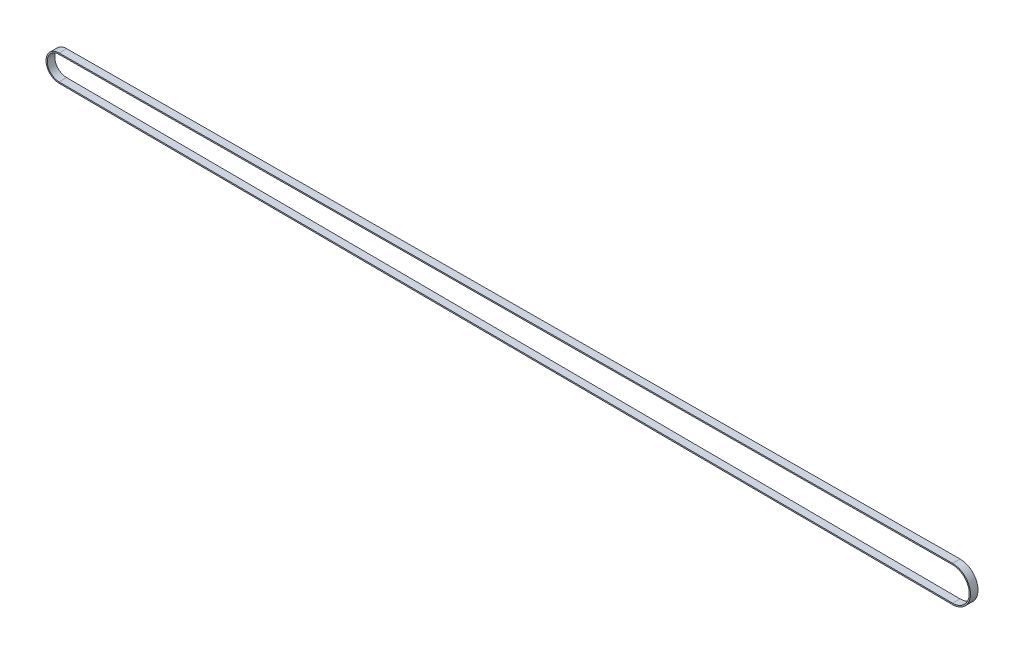
ISO-10303-21;
HEADER;
FILE_DESCRIPTION(('STEP AP214'),'2;1');
FILE_NAME('part.step','',(''),(''),'','','');
FILE_SCHEMA(('AUTOMOTIVE_DESIGN { 1 0 10303 214 1 1 1 1 }'));
ENDSEC;
DATA;
#1=APPLICATION_CONTEXT('core data for automotive mechanical design processes');
#2=APPLICATION_PROTOCOL_DEFINITION('international standard','automotive_design',2000,#1);
#3=PRODUCT_CONTEXT('',#1,'mechanical');
#4=PRODUCT('Part','Part','',(#3));
#5=PRODUCT_RELATED_PRODUCT_CATEGORY('part','',(#4));
#6=PRODUCT_DEFINITION_FORMATION('','',#4);
#7=PRODUCT_DEFINITION_CONTEXT('part definition',#1,'design');
#8=PRODUCT_DEFINITION('design','',#6,#7);
#9=PRODUCT_DEFINITION_SHAPE('','',#8);
#10=(LENGTH_UNIT() NAMED_UNIT(*) SI_UNIT(.MILLI.,.METRE.));
#11=(NAMED_UNIT(*) PLANE_ANGLE_UNIT() SI_UNIT($,.RADIAN.));
#12=(NAMED_UNIT(*) SI_UNIT($,.STERADIAN.) SOLID_ANGLE_UNIT());
#13=UNCERTAINTY_MEASURE_WITH_UNIT(LENGTH_MEASURE(1.E-05),#10,'distance_accuracy_value','');
#14=(GEOMETRIC_REPRESENTATION_CONTEXT(3) GLOBAL_UNCERTAINTY_ASSIGNED_CONTEXT((#13)) GLOBAL_UNIT_ASSIGNED_CONTEXT((#10,
#11,#12)) REPRESENTATION_CONTEXT('',''));
#15=CARTESIAN_POINT('',(0.,0.,0.));
#16=DIRECTION('',(0.,0.,1.));
#17=DIRECTION('',(1.,0.,0.));
#18=AXIS2_PLACEMENT_3D('',#15,#16,#17);
#19=CARTESIAN_POINT('',(-6.06884232011357,-3.48843129409174,328.056465315178));
#20=DIRECTION('',(0.,0.,1.));
#21=DIRECTION('',(1.,0.,0.));
#22=AXIS2_PLACEMENT_3D('',#19,#20,#21);
#23=CYLINDRICAL_SURFACE('',#22,7.15);
#24=CARTESIAN_POINT('',(-6.06884232011357,-3.48843129409174,331.056465315178));
#25=DIRECTION('',(0.,0.,-1.));
#26=DIRECTION('',(-1.,0.,0.));
#27=AXIS2_PLACEMENT_3D('',#24,#25,#26);
#28=CIRCLE('',#27,7.15);
#29=CARTESIAN_POINT('',(-6.10689554139574,-10.6383300313012,331.056465315178));
#30=VERTEX_POINT('',#29);
#31=CARTESIAN_POINT('',(-6.10689554140831,3.6614674431177,331.056465315178));
#32=VERTEX_POINT('',#31);
#33=EDGE_CURVE('E163',#30,#32,#28,.F.);
#34=ORIENTED_EDGE('',*,*,#33,.F.);
#35=DIRECTION('',(0.,0.,1.));
#36=VECTOR('',#35,1.);
#37=CARTESIAN_POINT('',(-6.10689554139574,-10.6383300313012,328.056465315178));
#38=LINE('',#37,#36);
#39=CARTESIAN_POINT('',(-6.10689554139574,-10.6383300313012,328.056465315178));
#40=VERTEX_POINT('',#39);
#41=EDGE_CURVE('E12',#40,#30,#38,.T.);
#42=ORIENTED_EDGE('',*,*,#41,.F.);
#43=CARTESIAN_POINT('',(-6.06884232011357,-3.48843129409174,328.056465315178));
#44=DIRECTION('',(0.,0.,-1.));
#45=DIRECTION('',(-1.,0.,0.));
#46=AXIS2_PLACEMENT_3D('',#43,#44,#45);
#47=CIRCLE('',#46,7.15);
#48=CARTESIAN_POINT('',(-6.10689554140831,3.6614674431177,328.056465315178));
#49=VERTEX_POINT('',#48);
#50=EDGE_CURVE('E167',#40,#49,#47,.F.);
#51=ORIENTED_EDGE('',*,*,#50,.T.);
#52=DIRECTION('',(0.,0.,1.));
#53=VECTOR('',#52,1.);
#54=CARTESIAN_POINT('',(-6.10689554140831,3.6614674431177,328.056465315178));
#55=LINE('',#54,#53);
#56=EDGE_CURVE('E64',#49,#32,#55,.T.);
#57=ORIENTED_EDGE('',*,*,#56,.T.);
#58=EDGE_LOOP('',(#34,#42,#51,#57));
#59=FACE_BOUND('',#58,.T.);
#60=ADVANCED_FACE('F61',(#59),#23,.T.);
#61=CARTESIAN_POINT('',(-6.10689554139574,-10.6383300313012,328.056465315178));
#62=DIRECTION('',(-0.00532212885065316,-0.999985837371958,0.));
#63=DIRECTION('',(0.999985837371959,-0.00532212885065316,0.));
#64=AXIS2_PLACEMENT_3D('',#61,#62,#63);
#65=PLANE('',#64);
#66=DIRECTION('',(0.999985837371959,-0.00532212885065316,0.));
#67=VECTOR('',#66,1.);
#68=CARTESIAN_POINT('',(-6.10689554139574,-10.6383300313012,331.056465315178));
#69=LINE('',#68,#67);
#70=CARTESIAN_POINT('',(-363.096783496579,-8.73835694061135,331.056465315178));
#71=VERTEX_POINT('',#70);
#72=EDGE_CURVE('E171',#71,#30,#69,.T.);
#73=ORIENTED_EDGE('',*,*,#72,.F.);
#74=DIRECTION('',(0.,0.,1.));
#75=VECTOR('',#74,1.);
#76=CARTESIAN_POINT('',(-363.096783496579,-8.73835694061135,328.056465315178));
#77=LINE('',#76,#75);
#78=CARTESIAN_POINT('',(-363.096783496579,-8.73835694061135,328.056465315178));
#79=VERTEX_POINT('',#78);
#80=EDGE_CURVE('E69',#79,#71,#77,.T.);
#81=ORIENTED_EDGE('',*,*,#80,.F.);
#82=DIRECTION('',(0.999985837371959,-0.00532212885065316,0.));
#83=VECTOR('',#82,1.);
#84=CARTESIAN_POINT('',(-6.10689554139574,-10.6383300313012,328.056465315178));
#85=LINE('',#84,#83);
#86=EDGE_CURVE('E178',#79,#40,#85,.T.);
#87=ORIENTED_EDGE('',*,*,#86,.T.);
#88=ORIENTED_EDGE('',*,*,#41,.T.);
#89=EDGE_LOOP('',(#73,#81,#87,#88));
#90=FACE_BOUND('',#89,.T.);
#91=ADVANCED_FACE('F207',(#90),#65,.T.);
#92=CARTESIAN_POINT('',(-363.068842320113,-3.48843129440857,328.056465315178));
#93=DIRECTION('',(0.,0.,1.));
#94=DIRECTION('',(1.,0.,0.));
#95=AXIS2_PLACEMENT_3D('',#92,#93,#94);
#96=CYLINDRICAL_SURFACE('',#95,5.25);
#97=CARTESIAN_POINT('',(-363.068842320113,-3.48843129440857,331.056465315178));
#98=DIRECTION('',(0.,0.,-1.));
#99=DIRECTION('',(-1.,0.,0.));
#100=AXIS2_PLACEMENT_3D('',#97,#98,#99);
#101=CIRCLE('',#100,5.25);
#102=CARTESIAN_POINT('',(-363.096783496589,1.76149435179417,331.056465315178));
#103=VERTEX_POINT('',#102);
#104=EDGE_CURVE('E188',#103,#71,#101,.F.);
#105=ORIENTED_EDGE('',*,*,#104,.F.);
#106=DIRECTION('',(0.,0.,1.));
#107=VECTOR('',#106,1.);
#108=CARTESIAN_POINT('',(-363.096783496589,1.76149435179417,328.056465315178));
#109=LINE('',#108,#107);
#110=CARTESIAN_POINT('',(-363.096783496589,1.76149435179417,328.056465315178));
#111=VERTEX_POINT('',#110);
#112=EDGE_CURVE('E194',#111,#103,#109,.T.);
#113=ORIENTED_EDGE('',*,*,#112,.F.);
#114=CARTESIAN_POINT('',(-363.068842320113,-3.48843129440857,328.056465315178));
#115=DIRECTION('',(0.,0.,-1.));
#116=DIRECTION('',(-1.,0.,0.));
#117=AXIS2_PLACEMENT_3D('',#114,#115,#116);
#118=CIRCLE('',#117,5.25);
#119=EDGE_CURVE('E175',#111,#79,#118,.F.);
#120=ORIENTED_EDGE('',*,*,#119,.T.);
#121=ORIENTED_EDGE('',*,*,#80,.T.);
#122=EDGE_LOOP('',(#105,#113,#120,#121));
#123=FACE_BOUND('',#122,.T.);
#124=ADVANCED_FACE('F211',(#123),#96,.T.);
#125=CARTESIAN_POINT('',(-6.10689554140843,3.6614674431177,328.056465315178));
#126=DIRECTION('',(-0.00532212885242809,0.999985837371949,0.));
#127=DIRECTION('',(-0.999985837371949,-0.0053221288524281,0.));
#128=AXIS2_PLACEMENT_3D('',#125,#126,#127);
#129=PLANE('',#128);
#130=DIRECTION('',(-0.999985837371949,-0.0053221288524281,0.));
#131=VECTOR('',#130,1.);
#132=CARTESIAN_POINT('',(-6.10689554140843,3.6614674431177,331.056465315178));
#133=LINE('',#132,#131);
#134=EDGE_CURVE('E184',#32,#103,#133,.T.);
#135=ORIENTED_EDGE('',*,*,#134,.F.);
#136=ORIENTED_EDGE('',*,*,#56,.F.);
#137=DIRECTION('',(-0.999985837371949,-0.0053221288524281,0.));
#138=VECTOR('',#137,1.);
#139=CARTESIAN_POINT('',(-6.10689554140843,3.6614674431177,328.056465315178));
#140=LINE('',#139,#138);
#141=EDGE_CURVE('E170',#49,#111,#140,.T.);
#142=ORIENTED_EDGE('',*,*,#141,.T.);
#143=ORIENTED_EDGE('',*,*,#112,.T.);
#144=EDGE_LOOP('',(#135,#136,#142,#143));
#145=FACE_BOUND('',#144,.T.);
#146=ADVANCED_FACE('F202',(#145),#129,.T.);
#147=CARTESIAN_POINT('',(-6.06884232011357,-3.48843129409174,328.056465315178));
#148=DIRECTION('',(0.,0.,-1.));
#149=DIRECTION('',(-1.,0.,0.));
#150=AXIS2_PLACEMENT_3D('',#147,#148,#149);
#151=PLANE('',#150);
#152=CARTESIAN_POINT('',(-6.06884232011357,-3.48843129409174,328.056465315178));
#153=DIRECTION('',(0.,0.,1.));
#154=DIRECTION('',(-1.,0.,0.));
#155=AXIS2_PLACEMENT_3D('',#152,#153,#154);
#156=CIRCLE('',#155,6.65);
#157=CARTESIAN_POINT('',(-6.10423447697041,-10.1383371126153,328.056465315178));
#158=VERTEX_POINT('',#157);
#159=CARTESIAN_POINT('',(-6.10423447698221,3.16147452443173,328.056465315178));
#160=VERTEX_POINT('',#159);
#161=EDGE_CURVE('E128',#158,#160,#156,.T.);
#162=ORIENTED_EDGE('',*,*,#161,.T.);
#163=DIRECTION('',(-0.999985837371949,-0.0053221288524281,0.));
#164=VECTOR('',#163,1.);
#165=CARTESIAN_POINT('',(-363.094122432162,1.26150143310819,328.056465315178));
#166=LINE('',#165,#164);
#167=CARTESIAN_POINT('',(-363.094122432162,1.26150143310819,328.056465315178));
#168=VERTEX_POINT('',#167);
#169=EDGE_CURVE('E137',#160,#168,#166,.T.);
#170=ORIENTED_EDGE('',*,*,#169,.T.);
#171=CARTESIAN_POINT('',(-363.068842320113,-3.48843129440857,328.056465315178));
#172=DIRECTION('',(0.,0.,1.));
#173=DIRECTION('',(-1.,0.,0.));
#174=AXIS2_PLACEMENT_3D('',#171,#172,#173);
#175=CIRCLE('',#174,4.75);
#176=CARTESIAN_POINT('',(-363.094122432154,-8.23836402192537,328.056465315178));
#177=VERTEX_POINT('',#176);
#178=EDGE_CURVE('E77',#168,#177,#175,.T.);
#179=ORIENTED_EDGE('',*,*,#178,.T.);
#180=DIRECTION('',(0.999985837371959,-0.00532212885065316,0.));
#181=VECTOR('',#180,1.);
#182=CARTESIAN_POINT('',(-6.10423447697041,-10.1383371126153,328.056465315178));
#183=LINE('',#182,#181);
#184=EDGE_CURVE('E134',#177,#158,#183,.T.);
#185=ORIENTED_EDGE('',*,*,#184,.T.);
#186=EDGE_LOOP('',(#162,#170,#179,#185));
#187=FACE_BOUND('',#186,.T.);
#188=ORIENTED_EDGE('',*,*,#50,.F.);
#189=ORIENTED_EDGE('',*,*,#86,.F.);
#190=ORIENTED_EDGE('',*,*,#119,.F.);
#191=ORIENTED_EDGE('',*,*,#141,.F.);
#192=EDGE_LOOP('',(#188,#189,#190,#191));
#193=FACE_BOUND('',#192,.T.);
#194=ADVANCED_FACE('F142',(#187,#193),#151,.T.);
#195=CARTESIAN_POINT('',(-6.06884232011357,-3.48843129409174,331.056465315178));
#196=DIRECTION('',(0.,0.,-1.));
#197=DIRECTION('',(-1.,0.,0.));
#198=AXIS2_PLACEMENT_3D('',#195,#196,#197);
#199=PLANE('',#198);
#200=DIRECTION('',(-0.999985837371949,-0.0053221288524281,0.));
#201=VECTOR('',#200,1.);
#202=CARTESIAN_POINT('',(-363.094122432162,1.26150143310819,331.056465315178));
#203=LINE('',#202,#201);
#204=CARTESIAN_POINT('',(-6.10423447698221,3.16147452443173,331.056465315178));
#205=VERTEX_POINT('',#204);
#206=CARTESIAN_POINT('',(-363.094122432162,1.26150143310819,331.056465315178));
#207=VERTEX_POINT('',#206);
#208=EDGE_CURVE('E156',#205,#207,#203,.T.);
#209=ORIENTED_EDGE('',*,*,#208,.F.);
#210=CARTESIAN_POINT('',(-6.06884232011357,-3.48843129409174,331.056465315178));
#211=DIRECTION('',(0.,0.,1.));
#212=DIRECTION('',(-1.,0.,0.));
#213=AXIS2_PLACEMENT_3D('',#210,#211,#212);
#214=CIRCLE('',#213,6.65);
#215=CARTESIAN_POINT('',(-6.10423447697041,-10.1383371126153,331.056465315178));
#216=VERTEX_POINT('',#215);
#217=EDGE_CURVE('E85',#216,#205,#214,.T.);
#218=ORIENTED_EDGE('',*,*,#217,.F.);
#219=DIRECTION('',(0.999985837371959,-0.00532212885065316,0.));
#220=VECTOR('',#219,1.);
#221=CARTESIAN_POINT('',(-6.10423447697041,-10.1383371126153,331.056465315178));
#222=LINE('',#221,#220);
#223=CARTESIAN_POINT('',(-363.094122432154,-8.23836402192537,331.056465315178));
#224=VERTEX_POINT('',#223);
#225=EDGE_CURVE('E145',#224,#216,#222,.T.);
#226=ORIENTED_EDGE('',*,*,#225,.F.);
#227=CARTESIAN_POINT('',(-363.068842320113,-3.48843129440857,331.056465315178));
#228=DIRECTION('',(0.,0.,1.));
#229=DIRECTION('',(-1.,0.,0.));
#230=AXIS2_PLACEMENT_3D('',#227,#228,#229);
#231=CIRCLE('',#230,4.75);
#232=EDGE_CURVE('E149',#207,#224,#231,.T.);
#233=ORIENTED_EDGE('',*,*,#232,.F.);
#234=EDGE_LOOP('',(#209,#218,#226,#233));
#235=FACE_BOUND('',#234,.T.);
#236=ORIENTED_EDGE('',*,*,#33,.T.);
#237=ORIENTED_EDGE('',*,*,#134,.T.);
#238=ORIENTED_EDGE('',*,*,#104,.T.);
#239=ORIENTED_EDGE('',*,*,#72,.T.);
#240=EDGE_LOOP('',(#236,#237,#238,#239));
#241=FACE_BOUND('',#240,.T.);
#242=ADVANCED_FACE('F204',(#235,#241),#199,.F.);
#243=CARTESIAN_POINT('',(-6.06884232011357,-3.48843129409174,328.056465315178));
#244=DIRECTION('',(0.,0.,1.));
#245=DIRECTION('',(1.,0.,0.));
#246=AXIS2_PLACEMENT_3D('',#243,#244,#245);
#247=CYLINDRICAL_SURFACE('',#246,6.65);
#248=ORIENTED_EDGE('',*,*,#217,.T.);
#249=DIRECTION('',(0.,0.,1.));
#250=VECTOR('',#249,1.);
#251=CARTESIAN_POINT('',(-6.10423447698221,3.16147452443173,328.056465315178));
#252=LINE('',#251,#250);
#253=EDGE_CURVE('E124',#160,#205,#252,.T.);
#254=ORIENTED_EDGE('',*,*,#253,.F.);
#255=ORIENTED_EDGE('',*,*,#161,.F.);
#256=DIRECTION('',(0.,0.,1.));
#257=VECTOR('',#256,1.);
#258=CARTESIAN_POINT('',(-6.10423447697041,-10.1383371126153,328.056465315178));
#259=LINE('',#258,#257);
#260=EDGE_CURVE('E161',#158,#216,#259,.T.);
#261=ORIENTED_EDGE('',*,*,#260,.T.);
#262=EDGE_LOOP('',(#248,#254,#255,#261));
#263=FACE_BOUND('',#262,.T.);
#264=ADVANCED_FACE('F126',(#263),#247,.F.);
#265=CARTESIAN_POINT('',(-6.10423447697041,-10.1383371126153,328.056465315178));
#266=DIRECTION('',(-0.00532212885065316,-0.999985837371958,0.));
#267=DIRECTION('',(0.999985837371959,-0.00532212885065316,0.));
#268=AXIS2_PLACEMENT_3D('',#265,#266,#267);
#269=PLANE('',#268);
#270=ORIENTED_EDGE('',*,*,#225,.T.);
#271=ORIENTED_EDGE('',*,*,#260,.F.);
#272=ORIENTED_EDGE('',*,*,#184,.F.);
#273=DIRECTION('',(0.,0.,1.));
#274=VECTOR('',#273,1.);
#275=CARTESIAN_POINT('',(-363.094122432154,-8.23836402192537,328.056465315178));
#276=LINE('',#275,#274);
#277=EDGE_CURVE('E164',#177,#224,#276,.T.);
#278=ORIENTED_EDGE('',*,*,#277,.T.);
#279=EDGE_LOOP('',(#270,#271,#272,#278));
#280=FACE_BOUND('',#279,.T.);
#281=ADVANCED_FACE('F263',(#280),#269,.F.);
#282=CARTESIAN_POINT('',(-363.068842320113,-3.48843129440857,328.056465315178));
#283=DIRECTION('',(0.,0.,1.));
#284=DIRECTION('',(1.,0.,0.));
#285=AXIS2_PLACEMENT_3D('',#282,#283,#284);
#286=CYLINDRICAL_SURFACE('',#285,4.75);
#287=ORIENTED_EDGE('',*,*,#232,.T.);
#288=ORIENTED_EDGE('',*,*,#277,.F.);
#289=ORIENTED_EDGE('',*,*,#178,.F.);
#290=DIRECTION('',(0.,0.,1.));
#291=VECTOR('',#290,1.);
#292=CARTESIAN_POINT('',(-363.094122432162,1.26150143310819,328.056465315178));
#293=LINE('',#292,#291);
#294=EDGE_CURVE('E133',#168,#207,#293,.T.);
#295=ORIENTED_EDGE('',*,*,#294,.T.);
#296=EDGE_LOOP('',(#287,#288,#289,#295));
#297=FACE_BOUND('',#296,.T.);
#298=ADVANCED_FACE('F272',(#297),#286,.F.);
#299=CARTESIAN_POINT('',(-363.094122432162,1.26150143310819,328.056465315178));
#300=DIRECTION('',(-0.00532212885242809,0.999985837371949,0.));
#301=DIRECTION('',(-0.999985837371949,-0.0053221288524281,0.));
#302=AXIS2_PLACEMENT_3D('',#299,#300,#301);
#303=PLANE('',#302);
#304=ORIENTED_EDGE('',*,*,#208,.T.);
#305=ORIENTED_EDGE('',*,*,#294,.F.);
#306=ORIENTED_EDGE('',*,*,#169,.F.);
#307=ORIENTED_EDGE('',*,*,#253,.T.);
#308=EDGE_LOOP('',(#304,#305,#306,#307));
#309=FACE_BOUND('',#308,.T.);
#310=ADVANCED_FACE('F138',(#309),#303,.F.);
#311=CLOSED_SHELL('',(#60,#91,#124,#146,#194,#242,#264,#281,#298,#310));
#312=MANIFOLD_SOLID_BREP('B2',#311);
#313=ADVANCED_BREP_SHAPE_REPRESENTATION('',(#18,#312),#14);
#314=SHAPE_DEFINITION_REPRESENTATION(#9,#313);
ENDSEC;
END-ISO-10303-21;
